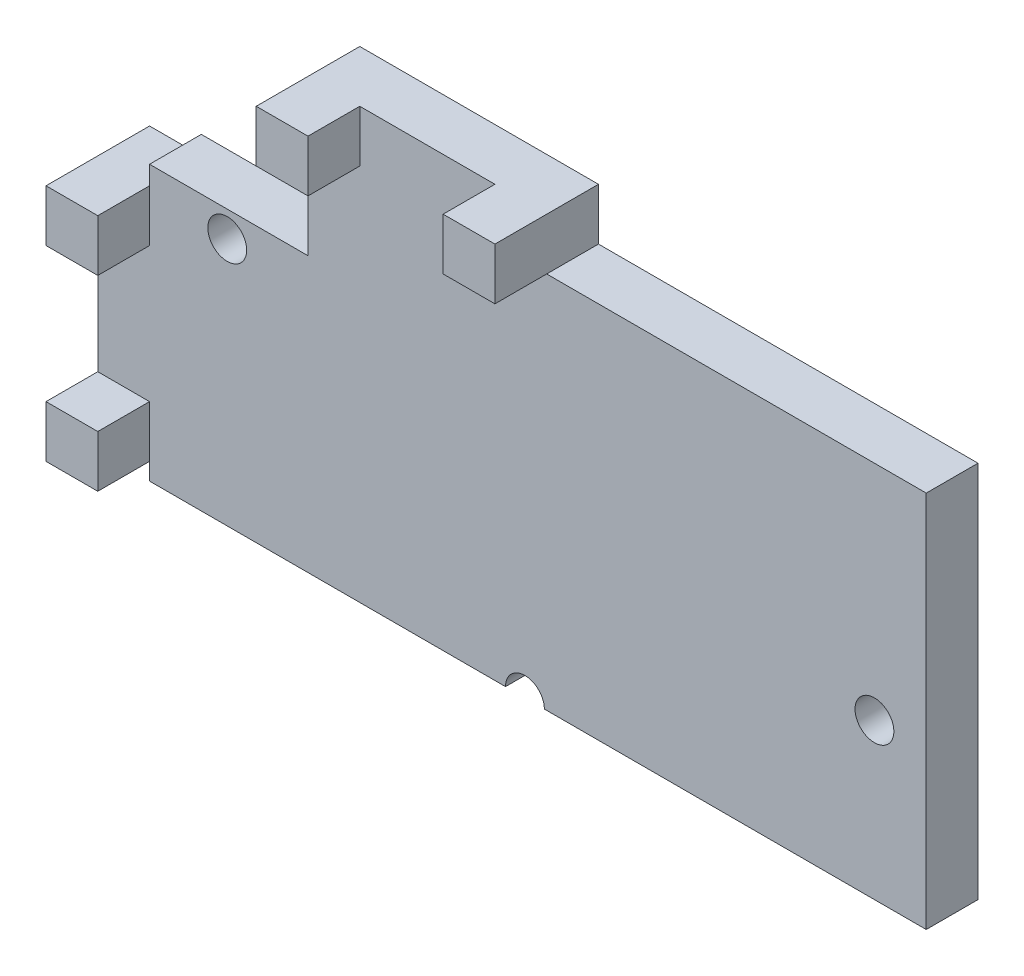
ISO-10303-21;
HEADER;
FILE_DESCRIPTION(('STEP AP214'),'2;1');
FILE_NAME('part.step','',(''),(''),'','','');
FILE_SCHEMA(('AUTOMOTIVE_DESIGN { 1 0 10303 214 1 1 1 1 }'));
ENDSEC;
DATA;
#1=APPLICATION_CONTEXT('core data for automotive mechanical design processes');
#2=APPLICATION_PROTOCOL_DEFINITION('international standard','automotive_design',2000,#1);
#3=PRODUCT_CONTEXT('',#1,'mechanical');
#4=PRODUCT('Part','Part','',(#3));
#5=PRODUCT_RELATED_PRODUCT_CATEGORY('part','',(#4));
#6=PRODUCT_DEFINITION_FORMATION('','',#4);
#7=PRODUCT_DEFINITION_CONTEXT('part definition',#1,'design');
#8=PRODUCT_DEFINITION('design','',#6,#7);
#9=PRODUCT_DEFINITION_SHAPE('','',#8);
#10=(LENGTH_UNIT() NAMED_UNIT(*) SI_UNIT(.MILLI.,.METRE.));
#11=(NAMED_UNIT(*) PLANE_ANGLE_UNIT() SI_UNIT($,.RADIAN.));
#12=(NAMED_UNIT(*) SI_UNIT($,.STERADIAN.) SOLID_ANGLE_UNIT());
#13=UNCERTAINTY_MEASURE_WITH_UNIT(LENGTH_MEASURE(1.E-05),#10,'distance_accuracy_value','');
#14=(GEOMETRIC_REPRESENTATION_CONTEXT(3) GLOBAL_UNCERTAINTY_ASSIGNED_CONTEXT((#13)) GLOBAL_UNIT_ASSIGNED_CONTEXT((#10,
#11,#12)) REPRESENTATION_CONTEXT('',''));
#15=CARTESIAN_POINT('',(0.,0.,0.));
#16=DIRECTION('',(0.,0.,1.));
#17=DIRECTION('',(1.,0.,0.));
#18=AXIS2_PLACEMENT_3D('',#15,#16,#17);
#19=CARTESIAN_POINT('',(-5.5945945945946,-3.48648648648649,1.));
#20=DIRECTION('',(0.,1.,0.));
#21=DIRECTION('',(0.,0.,1.));
#22=AXIS2_PLACEMENT_3D('',#19,#20,#21);
#23=PLANE('',#22);
#24=DIRECTION('',(1.,0.,0.));
#25=VECTOR('',#24,1.);
#26=CARTESIAN_POINT('',(-5.5945945945946,-3.48648648648649,1.));
#27=LINE('',#26,#25);
#28=CARTESIAN_POINT('',(2.0304054054054,-3.48648648648649,1.));
#29=VERTEX_POINT('',#28);
#30=CARTESIAN_POINT('',(9.4054054054054,-3.48648648648649,1.));
#31=VERTEX_POINT('',#30);
#32=EDGE_CURVE('E221',#29,#31,#27,.T.);
#33=ORIENTED_EDGE('',*,*,#32,.F.);
#34=DIRECTION('',(0.,0.,-1.));
#35=VECTOR('',#34,1.);
#36=CARTESIAN_POINT('',(2.0304054054054,-3.48648648648649,1.));
#37=LINE('',#36,#35);
#38=CARTESIAN_POINT('',(2.0304054054054,-3.48648648648649,0.));
#39=VERTEX_POINT('',#38);
#40=EDGE_CURVE('E200',#29,#39,#37,.T.);
#41=ORIENTED_EDGE('',*,*,#40,.T.);
#42=DIRECTION('',(1.,0.,0.));
#43=VECTOR('',#42,1.);
#44=CARTESIAN_POINT('',(-5.5945945945946,-3.48648648648649,0.));
#45=LINE('',#44,#43);
#46=CARTESIAN_POINT('',(9.4054054054054,-3.48648648648649,0.));
#47=VERTEX_POINT('',#46);
#48=EDGE_CURVE('E234',#39,#47,#45,.T.);
#49=ORIENTED_EDGE('',*,*,#48,.T.);
#50=DIRECTION('',(0.,0.,-1.));
#51=VECTOR('',#50,1.);
#52=CARTESIAN_POINT('',(9.4054054054054,-3.48648648648649,1.));
#53=LINE('',#52,#51);
#54=EDGE_CURVE('E41',#31,#47,#53,.T.);
#55=ORIENTED_EDGE('',*,*,#54,.F.);
#56=EDGE_LOOP('',(#33,#41,#49,#55));
#57=FACE_BOUND('',#56,.T.);
#58=ADVANCED_FACE('F33',(#57),#23,.F.);
#59=CARTESIAN_POINT('',(0.,0.,1.));
#60=DIRECTION('',(0.,0.,1.));
#61=DIRECTION('',(1.,0.,0.));
#62=AXIS2_PLACEMENT_3D('',#59,#60,#61);
#63=PLANE('',#62);
#64=CARTESIAN_POINT('',(1.6554054054054,-3.48648648648649,1.));
#65=DIRECTION('',(0.,0.,-1.));
#66=DIRECTION('',(-1.,0.,0.));
#67=AXIS2_PLACEMENT_3D('',#64,#65,#66);
#68=CIRCLE('',#67,0.375000000000001);
#69=CARTESIAN_POINT('',(1.2804054054054,-3.48648648648649,1.));
#70=VERTEX_POINT('',#69);
#71=EDGE_CURVE('E197',#70,#29,#68,.T.);
#72=ORIENTED_EDGE('',*,*,#71,.T.);
#73=ORIENTED_EDGE('',*,*,#32,.T.);
#74=DIRECTION('',(0.,1.,0.));
#75=VECTOR('',#74,1.);
#76=CARTESIAN_POINT('',(9.4054054054054,3.81351351351351,1.));
#77=LINE('',#76,#75);
#78=CARTESIAN_POINT('',(9.4054054054054,3.81351351351351,1.));
#79=VERTEX_POINT('',#78);
#80=EDGE_CURVE('E220',#31,#79,#77,.T.);
#81=ORIENTED_EDGE('',*,*,#80,.T.);
#82=DIRECTION('',(-1.,0.,0.));
#83=VECTOR('',#82,1.);
#84=CARTESIAN_POINT('',(-5.5945945945946,3.81351351351351,1.));
#85=LINE('',#84,#83);
#86=CARTESIAN_POINT('',(2.0754054054054,3.81351351351351,1.));
#87=VERTEX_POINT('',#86);
#88=EDGE_CURVE('E223',#79,#87,#85,.T.);
#89=ORIENTED_EDGE('',*,*,#88,.T.);
#90=DIRECTION('',(1.,0.,0.));
#91=VECTOR('',#90,1.);
#92=CARTESIAN_POINT('',(2.0754054054054,3.81351351351351,1.));
#93=LINE('',#92,#91);
#94=CARTESIAN_POINT('',(1.0754054054054,3.81351351351351,1.));
#95=VERTEX_POINT('',#94);
#96=EDGE_CURVE('E264',#95,#87,#93,.T.);
#97=ORIENTED_EDGE('',*,*,#96,.F.);
#98=DIRECTION('',(0.,-1.,0.));
#99=VECTOR('',#98,1.);
#100=CARTESIAN_POINT('',(1.0754054054054,3.81351351351351,1.));
#101=LINE('',#100,#99);
#102=CARTESIAN_POINT('',(1.0754054054054,4.81351351351351,1.));
#103=VERTEX_POINT('',#102);
#104=EDGE_CURVE('E277',#103,#95,#101,.T.);
#105=ORIENTED_EDGE('',*,*,#104,.F.);
#106=DIRECTION('',(-1.,0.,0.));
#107=VECTOR('',#106,1.);
#108=CARTESIAN_POINT('',(-2.5345945945946,4.81351351351351,1.));
#109=LINE('',#108,#107);
#110=CARTESIAN_POINT('',(-1.53459459459459,4.81351351351351,1.));
#111=VERTEX_POINT('',#110);
#112=EDGE_CURVE('E317',#103,#111,#109,.T.);
#113=ORIENTED_EDGE('',*,*,#112,.T.);
#114=DIRECTION('',(0.,1.,0.));
#115=VECTOR('',#114,1.);
#116=CARTESIAN_POINT('',(-1.53459459459459,4.81351351351351,1.));
#117=LINE('',#116,#115);
#118=CARTESIAN_POINT('',(-1.53459459459459,3.81351351351351,1.));
#119=VERTEX_POINT('',#118);
#120=EDGE_CURVE('E297',#119,#111,#117,.T.);
#121=ORIENTED_EDGE('',*,*,#120,.F.);
#122=DIRECTION('',(1.,0.,0.));
#123=VECTOR('',#122,1.);
#124=CARTESIAN_POINT('',(-2.53459459459459,3.81351351351351,1.));
#125=LINE('',#124,#123);
#126=CARTESIAN_POINT('',(-2.5345945945946,3.81351351351351,1.));
#127=VERTEX_POINT('',#126);
#128=EDGE_CURVE('E292',#127,#119,#125,.T.);
#129=ORIENTED_EDGE('',*,*,#128,.F.);
#130=DIRECTION('',(0.,-1.,0.));
#131=VECTOR('',#130,1.);
#132=CARTESIAN_POINT('',(-2.5345945945946,3.81351351351351,1.));
#133=LINE('',#132,#131);
#134=CARTESIAN_POINT('',(-2.5345945945946,1.81351351351351,1.));
#135=VERTEX_POINT('',#134);
#136=EDGE_CURVE('E329',#127,#135,#133,.T.);
#137=ORIENTED_EDGE('',*,*,#136,.T.);
#138=DIRECTION('',(-1.,0.,0.));
#139=VECTOR('',#138,1.);
#140=CARTESIAN_POINT('',(-5.5945945945946,1.81351351351351,1.));
#141=LINE('',#140,#139);
#142=CARTESIAN_POINT('',(-5.5945945945946,1.81351351351351,1.));
#143=VERTEX_POINT('',#142);
#144=EDGE_CURVE('E331',#135,#143,#141,.T.);
#145=ORIENTED_EDGE('',*,*,#144,.T.);
#146=DIRECTION('',(0.,-1.,0.));
#147=VECTOR('',#146,1.);
#148=CARTESIAN_POINT('',(-5.5945945945946,3.81351351351351,1.));
#149=LINE('',#148,#147);
#150=CARTESIAN_POINT('',(-5.5945945945946,1.45351351351351,1.));
#151=VERTEX_POINT('',#150);
#152=EDGE_CURVE('E225',#143,#151,#149,.T.);
#153=ORIENTED_EDGE('',*,*,#152,.T.);
#154=DIRECTION('',(0.,1.,0.));
#155=VECTOR('',#154,1.);
#156=CARTESIAN_POINT('',(-5.5945945945946,1.45351351351351,1.));
#157=LINE('',#156,#155);
#158=CARTESIAN_POINT('',(-5.5945945945946,0.453513513513511,1.));
#159=VERTEX_POINT('',#158);
#160=EDGE_CURVE('E406',#159,#151,#157,.T.);
#161=ORIENTED_EDGE('',*,*,#160,.F.);
#162=DIRECTION('',(1.,0.,0.));
#163=VECTOR('',#162,1.);
#164=CARTESIAN_POINT('',(-6.5945945945946,0.453513513513511,1.));
#165=LINE('',#164,#163);
#166=CARTESIAN_POINT('',(-6.5945945945946,0.453513513513511,1.));
#167=VERTEX_POINT('',#166);
#168=EDGE_CURVE('E408',#167,#159,#165,.T.);
#169=ORIENTED_EDGE('',*,*,#168,.F.);
#170=DIRECTION('',(0.,1.,0.));
#171=VECTOR('',#170,1.);
#172=CARTESIAN_POINT('',(-6.5945945945946,-3.15648648648649,1.));
#173=LINE('',#172,#171);
#174=CARTESIAN_POINT('',(-6.5945945945946,-2.15648648648649,1.));
#175=VERTEX_POINT('',#174);
#176=EDGE_CURVE('E445',#175,#167,#173,.T.);
#177=ORIENTED_EDGE('',*,*,#176,.F.);
#178=DIRECTION('',(-1.,0.,0.));
#179=VECTOR('',#178,1.);
#180=CARTESIAN_POINT('',(-6.5945945945946,-2.15648648648649,1.));
#181=LINE('',#180,#179);
#182=CARTESIAN_POINT('',(-5.5945945945946,-2.15648648648649,1.));
#183=VERTEX_POINT('',#182);
#184=EDGE_CURVE('E431',#183,#175,#181,.T.);
#185=ORIENTED_EDGE('',*,*,#184,.F.);
#186=DIRECTION('',(0.,1.,0.));
#187=VECTOR('',#186,1.);
#188=CARTESIAN_POINT('',(-5.5945945945946,-3.15648648648649,1.));
#189=LINE('',#188,#187);
#190=CARTESIAN_POINT('',(-5.5945945945946,-3.15648648648649,1.));
#191=VERTEX_POINT('',#190);
#192=EDGE_CURVE('E426',#191,#183,#189,.T.);
#193=ORIENTED_EDGE('',*,*,#192,.F.);
#194=CARTESIAN_POINT('',(-5.5945945945946,-3.48648648648649,1.));
#195=VERTEX_POINT('',#194);
#196=EDGE_CURVE('E219',#191,#195,#149,.T.);
#197=ORIENTED_EDGE('',*,*,#196,.T.);
#198=EDGE_CURVE('E210',#195,#70,#27,.T.);
#199=ORIENTED_EDGE('',*,*,#198,.T.);
#200=EDGE_LOOP('',(#72,#73,#81,#89,#97,#105,#113,#121,#129,#137,#145,#153,#161,#169,#177,#185,
#193,#197,#199));
#201=FACE_BOUND('',#200,.T.);
#202=CARTESIAN_POINT('',(-4.0945945945946,1.31351351351351,1.));
#203=DIRECTION('',(0.,0.,-1.));
#204=DIRECTION('',(-1.,0.,0.));
#205=AXIS2_PLACEMENT_3D('',#202,#203,#204);
#206=CIRCLE('',#205,0.375000000000001);
#207=CARTESIAN_POINT('',(-4.4695945945946,1.31351351351351,1.));
#208=VERTEX_POINT('',#207);
#209=EDGE_CURVE('E467',#208,#208,#206,.T.);
#210=ORIENTED_EDGE('',*,*,#209,.T.);
#211=EDGE_LOOP('',(#210));
#212=FACE_BOUND('',#211,.T.);
#213=CARTESIAN_POINT('',(8.4054054054054,-0.486486486486489,1.));
#214=DIRECTION('',(0.,0.,-1.));
#215=DIRECTION('',(-1.,0.,0.));
#216=AXIS2_PLACEMENT_3D('',#213,#214,#215);
#217=CIRCLE('',#216,0.375000000000001);
#218=CARTESIAN_POINT('',(8.0304054054054,-0.486486486486489,1.));
#219=VERTEX_POINT('',#218);
#220=EDGE_CURVE('E416',#219,#219,#217,.T.);
#221=ORIENTED_EDGE('',*,*,#220,.T.);
#222=EDGE_LOOP('',(#221));
#223=FACE_BOUND('',#222,.T.);
#224=ADVANCED_FACE('F215',(#201,#212,#223),#63,.T.);
#225=CARTESIAN_POINT('',(-5.5945945945946,3.81351351351351,1.));
#226=DIRECTION('',(1.,0.,0.));
#227=DIRECTION('',(0.,0.,-1.));
#228=AXIS2_PLACEMENT_3D('',#225,#226,#227);
#229=PLANE('',#228);
#230=DIRECTION('',(0.,0.,-1.));
#231=VECTOR('',#230,1.);
#232=CARTESIAN_POINT('',(-5.5945945945946,1.45351351351351,1.));
#233=LINE('',#232,#231);
#234=CARTESIAN_POINT('',(-5.5945945945946,1.45351351351351,0.));
#235=VERTEX_POINT('',#234);
#236=EDGE_CURVE('E360',#151,#235,#233,.T.);
#237=ORIENTED_EDGE('',*,*,#236,.F.);
#238=ORIENTED_EDGE('',*,*,#152,.F.);
#239=DIRECTION('',(0.,0.,-1.));
#240=VECTOR('',#239,1.);
#241=CARTESIAN_POINT('',(-5.5945945945946,1.81351351351351,1.));
#242=LINE('',#241,#240);
#243=CARTESIAN_POINT('',(-5.5945945945946,1.81351351351351,0.));
#244=VERTEX_POINT('',#243);
#245=EDGE_CURVE('E339',#143,#244,#242,.T.);
#246=ORIENTED_EDGE('',*,*,#245,.T.);
#247=DIRECTION('',(0.,-1.,0.));
#248=VECTOR('',#247,1.);
#249=CARTESIAN_POINT('',(-5.5945945945946,3.81351351351351,0.));
#250=LINE('',#249,#248);
#251=EDGE_CURVE('E232',#244,#235,#250,.T.);
#252=ORIENTED_EDGE('',*,*,#251,.T.);
#253=EDGE_LOOP('',(#237,#238,#246,#252));
#254=FACE_BOUND('',#253,.T.);
#255=ADVANCED_FACE('F35',(#254),#229,.F.);
#256=DIRECTION('',(0.,0.,1.));
#257=VECTOR('',#256,1.);
#258=CARTESIAN_POINT('',(-5.5945945945946,-3.15648648648649,0.));
#259=LINE('',#258,#257);
#260=CARTESIAN_POINT('',(-5.5945945945946,-3.15648648648649,0.));
#261=VERTEX_POINT('',#260);
#262=EDGE_CURVE('E369',#261,#191,#259,.T.);
#263=ORIENTED_EDGE('',*,*,#262,.F.);
#264=CARTESIAN_POINT('',(-5.5945945945946,-3.48648648648649,0.));
#265=VERTEX_POINT('',#264);
#266=EDGE_CURVE('E235',#261,#265,#250,.T.);
#267=ORIENTED_EDGE('',*,*,#266,.T.);
#268=DIRECTION('',(0.,0.,-1.));
#269=VECTOR('',#268,1.);
#270=CARTESIAN_POINT('',(-5.5945945945946,-3.48648648648649,1.));
#271=LINE('',#270,#269);
#272=EDGE_CURVE('E11',#195,#265,#271,.T.);
#273=ORIENTED_EDGE('',*,*,#272,.F.);
#274=ORIENTED_EDGE('',*,*,#196,.F.);
#275=EDGE_LOOP('',(#263,#267,#273,#274));
#276=FACE_BOUND('',#275,.T.);
#277=ADVANCED_FACE('F477',(#276),#229,.F.);
#278=CARTESIAN_POINT('',(1.2804054054054,-3.48648648648649,0.));
#279=VERTEX_POINT('',#278);
#280=EDGE_CURVE('E213',#265,#279,#45,.T.);
#281=ORIENTED_EDGE('',*,*,#280,.T.);
#282=DIRECTION('',(0.,0.,-1.));
#283=VECTOR('',#282,1.);
#284=CARTESIAN_POINT('',(1.2804054054054,-3.48648648648649,1.));
#285=LINE('',#284,#283);
#286=EDGE_CURVE('E48',#279,#70,#285,.F.);
#287=ORIENTED_EDGE('',*,*,#286,.T.);
#288=ORIENTED_EDGE('',*,*,#198,.F.);
#289=ORIENTED_EDGE('',*,*,#272,.T.);
#290=EDGE_LOOP('',(#281,#287,#288,#289));
#291=FACE_BOUND('',#290,.T.);
#292=ADVANCED_FACE('F209',(#291),#23,.F.);
#293=CARTESIAN_POINT('',(9.4054054054054,3.81351351351351,1.));
#294=DIRECTION('',(-1.,0.,0.));
#295=DIRECTION('',(0.,0.,1.));
#296=AXIS2_PLACEMENT_3D('',#293,#294,#295);
#297=PLANE('',#296);
#298=DIRECTION('',(0.,1.,0.));
#299=VECTOR('',#298,1.);
#300=CARTESIAN_POINT('',(9.4054054054054,3.81351351351351,0.));
#301=LINE('',#300,#299);
#302=CARTESIAN_POINT('',(9.4054054054054,3.81351351351351,0.));
#303=VERTEX_POINT('',#302);
#304=EDGE_CURVE('E237',#47,#303,#301,.T.);
#305=ORIENTED_EDGE('',*,*,#304,.T.);
#306=DIRECTION('',(0.,0.,-1.));
#307=VECTOR('',#306,1.);
#308=CARTESIAN_POINT('',(9.4054054054054,3.81351351351351,1.));
#309=LINE('',#308,#307);
#310=EDGE_CURVE('E231',#79,#303,#309,.T.);
#311=ORIENTED_EDGE('',*,*,#310,.F.);
#312=ORIENTED_EDGE('',*,*,#80,.F.);
#313=ORIENTED_EDGE('',*,*,#54,.T.);
#314=EDGE_LOOP('',(#305,#311,#312,#313));
#315=FACE_BOUND('',#314,.T.);
#316=ADVANCED_FACE('F248',(#315),#297,.F.);
#317=CARTESIAN_POINT('',(-5.5945945945946,3.81351351351351,1.));
#318=DIRECTION('',(0.,-1.,0.));
#319=DIRECTION('',(0.,0.,-1.));
#320=AXIS2_PLACEMENT_3D('',#317,#318,#319);
#321=PLANE('',#320);
#322=DIRECTION('',(-1.,0.,0.));
#323=VECTOR('',#322,1.);
#324=CARTESIAN_POINT('',(-5.5945945945946,3.81351351351351,0.));
#325=LINE('',#324,#323);
#326=CARTESIAN_POINT('',(2.07540540540541,3.81351351351351,0.));
#327=VERTEX_POINT('',#326);
#328=EDGE_CURVE('E239',#303,#327,#325,.T.);
#329=ORIENTED_EDGE('',*,*,#328,.T.);
#330=DIRECTION('',(0.,0.,1.));
#331=VECTOR('',#330,1.);
#332=CARTESIAN_POINT('',(2.07540540540541,3.81351351351351,0.));
#333=LINE('',#332,#331);
#334=EDGE_CURVE('E262',#327,#87,#333,.T.);
#335=ORIENTED_EDGE('',*,*,#334,.T.);
#336=ORIENTED_EDGE('',*,*,#88,.F.);
#337=ORIENTED_EDGE('',*,*,#310,.T.);
#338=EDGE_LOOP('',(#329,#335,#336,#337));
#339=FACE_BOUND('',#338,.T.);
#340=ADVANCED_FACE('F260',(#339),#321,.F.);
#341=CARTESIAN_POINT('',(0.,0.,0.));
#342=DIRECTION('',(0.,0.,1.));
#343=DIRECTION('',(1.,0.,0.));
#344=AXIS2_PLACEMENT_3D('',#341,#342,#343);
#345=PLANE('',#344);
#346=CARTESIAN_POINT('',(-4.0945945945946,1.31351351351351,0.));
#347=DIRECTION('',(0.,0.,-1.));
#348=DIRECTION('',(-1.,0.,0.));
#349=AXIS2_PLACEMENT_3D('',#346,#347,#348);
#350=CIRCLE('',#349,0.375000000000001);
#351=CARTESIAN_POINT('',(-4.4695945945946,1.31351351351351,0.));
#352=VERTEX_POINT('',#351);
#353=EDGE_CURVE('E464',#352,#352,#350,.T.);
#354=ORIENTED_EDGE('',*,*,#353,.F.);
#355=EDGE_LOOP('',(#354));
#356=FACE_BOUND('',#355,.T.);
#357=CARTESIAN_POINT('',(8.4054054054054,-0.486486486486489,0.));
#358=DIRECTION('',(0.,0.,-1.));
#359=DIRECTION('',(-1.,0.,0.));
#360=AXIS2_PLACEMENT_3D('',#357,#358,#359);
#361=CIRCLE('',#360,0.375000000000001);
#362=CARTESIAN_POINT('',(8.0304054054054,-0.486486486486489,0.));
#363=VERTEX_POINT('',#362);
#364=EDGE_CURVE('E458',#363,#363,#361,.T.);
#365=ORIENTED_EDGE('',*,*,#364,.F.);
#366=EDGE_LOOP('',(#365));
#367=FACE_BOUND('',#366,.T.);
#368=ORIENTED_EDGE('',*,*,#48,.F.);
#369=CARTESIAN_POINT('',(1.6554054054054,-3.48648648648649,0.));
#370=DIRECTION('',(0.,0.,-1.));
#371=DIRECTION('',(-1.,0.,0.));
#372=AXIS2_PLACEMENT_3D('',#369,#370,#371);
#373=CIRCLE('',#372,0.375000000000001);
#374=EDGE_CURVE('E204',#279,#39,#373,.T.);
#375=ORIENTED_EDGE('',*,*,#374,.F.);
#376=ORIENTED_EDGE('',*,*,#280,.F.);
#377=ORIENTED_EDGE('',*,*,#266,.F.);
#378=DIRECTION('',(1.,0.,0.));
#379=VECTOR('',#378,1.);
#380=CARTESIAN_POINT('',(-6.5945945945946,-3.15648648648649,0.));
#381=LINE('',#380,#379);
#382=CARTESIAN_POINT('',(-6.5945945945946,-3.15648648648649,0.));
#383=VERTEX_POINT('',#382);
#384=EDGE_CURVE('E380',#383,#261,#381,.T.);
#385=ORIENTED_EDGE('',*,*,#384,.F.);
#386=DIRECTION('',(0.,-1.,0.));
#387=VECTOR('',#386,1.);
#388=CARTESIAN_POINT('',(-6.5945945945946,1.45351351351351,0.));
#389=LINE('',#388,#387);
#390=CARTESIAN_POINT('',(-6.5945945945946,1.45351351351351,0.));
#391=VERTEX_POINT('',#390);
#392=EDGE_CURVE('E368',#391,#383,#389,.T.);
#393=ORIENTED_EDGE('',*,*,#392,.F.);
#394=DIRECTION('',(1.,0.,0.));
#395=VECTOR('',#394,1.);
#396=CARTESIAN_POINT('',(-6.5945945945946,1.45351351351351,0.));
#397=LINE('',#396,#395);
#398=EDGE_CURVE('E355',#391,#235,#397,.T.);
#399=ORIENTED_EDGE('',*,*,#398,.T.);
#400=ORIENTED_EDGE('',*,*,#251,.F.);
#401=DIRECTION('',(-1.,0.,0.));
#402=VECTOR('',#401,1.);
#403=CARTESIAN_POINT('',(-5.5945945945946,1.81351351351351,0.));
#404=LINE('',#403,#402);
#405=CARTESIAN_POINT('',(-2.5345945945946,1.81351351351351,0.));
#406=VERTEX_POINT('',#405);
#407=EDGE_CURVE('E332',#406,#244,#404,.T.);
#408=ORIENTED_EDGE('',*,*,#407,.F.);
#409=DIRECTION('',(0.,-1.,0.));
#410=VECTOR('',#409,1.);
#411=CARTESIAN_POINT('',(-2.5345945945946,3.81351351351351,0.));
#412=LINE('',#411,#410);
#413=CARTESIAN_POINT('',(-2.5345945945946,4.81351351351351,0.));
#414=VERTEX_POINT('',#413);
#415=EDGE_CURVE('E325',#414,#406,#412,.T.);
#416=ORIENTED_EDGE('',*,*,#415,.F.);
#417=DIRECTION('',(-1.,0.,0.));
#418=VECTOR('',#417,1.);
#419=CARTESIAN_POINT('',(-2.5345945945946,4.81351351351351,0.));
#420=LINE('',#419,#418);
#421=CARTESIAN_POINT('',(2.07540540540541,4.81351351351351,0.));
#422=VERTEX_POINT('',#421);
#423=EDGE_CURVE('E319',#422,#414,#420,.T.);
#424=ORIENTED_EDGE('',*,*,#423,.F.);
#425=DIRECTION('',(0.,1.,0.));
#426=VECTOR('',#425,1.);
#427=CARTESIAN_POINT('',(2.07540540540541,3.81351351351351,0.));
#428=LINE('',#427,#426);
#429=EDGE_CURVE('E258',#327,#422,#428,.T.);
#430=ORIENTED_EDGE('',*,*,#429,.F.);
#431=ORIENTED_EDGE('',*,*,#328,.F.);
#432=ORIENTED_EDGE('',*,*,#304,.F.);
#433=EDGE_LOOP('',(#368,#375,#376,#377,#385,#393,#399,#400,#408,#416,#424,#430,#431,#432));
#434=FACE_BOUND('',#433,.T.);
#435=ADVANCED_FACE('F254',(#356,#367,#434),#345,.F.);
#436=CARTESIAN_POINT('',(-5.5945945945946,1.81351351351351,1.));
#437=DIRECTION('',(0.,-1.,0.));
#438=DIRECTION('',(1.,0.,0.));
#439=AXIS2_PLACEMENT_3D('',#436,#437,#438);
#440=PLANE('',#439);
#441=ORIENTED_EDGE('',*,*,#407,.T.);
#442=ORIENTED_EDGE('',*,*,#245,.F.);
#443=ORIENTED_EDGE('',*,*,#144,.F.);
#444=DIRECTION('',(0.,0.,-1.));
#445=VECTOR('',#444,1.);
#446=CARTESIAN_POINT('',(-2.5345945945946,1.81351351351351,1.));
#447=LINE('',#446,#445);
#448=EDGE_CURVE('E335',#135,#406,#447,.T.);
#449=ORIENTED_EDGE('',*,*,#448,.T.);
#450=EDGE_LOOP('',(#441,#442,#443,#449));
#451=FACE_BOUND('',#450,.T.);
#452=ADVANCED_FACE('F344',(#451),#440,.F.);
#453=CARTESIAN_POINT('',(-2.5345945945946,3.81351351351351,1.));
#454=DIRECTION('',(1.,0.,0.));
#455=DIRECTION('',(0.,0.,-1.));
#456=AXIS2_PLACEMENT_3D('',#453,#454,#455);
#457=PLANE('',#456);
#458=ORIENTED_EDGE('',*,*,#415,.T.);
#459=ORIENTED_EDGE('',*,*,#448,.F.);
#460=ORIENTED_EDGE('',*,*,#136,.F.);
#461=DIRECTION('',(0.,0.,-1.));
#462=VECTOR('',#461,1.);
#463=CARTESIAN_POINT('',(-2.53459459459459,3.81351351351351,2.));
#464=LINE('',#463,#462);
#465=CARTESIAN_POINT('',(-2.53459459459459,3.81351351351351,2.));
#466=VERTEX_POINT('',#465);
#467=EDGE_CURVE('E314',#466,#127,#464,.T.);
#468=ORIENTED_EDGE('',*,*,#467,.F.);
#469=DIRECTION('',(0.,-1.,0.));
#470=VECTOR('',#469,1.);
#471=CARTESIAN_POINT('',(-2.5345945945946,4.81351351351351,2.));
#472=LINE('',#471,#470);
#473=CARTESIAN_POINT('',(-2.5345945945946,4.81351351351351,2.));
#474=VERTEX_POINT('',#473);
#475=EDGE_CURVE('E293',#474,#466,#472,.T.);
#476=ORIENTED_EDGE('',*,*,#475,.F.);
#477=DIRECTION('',(0.,0.,1.));
#478=VECTOR('',#477,1.);
#479=CARTESIAN_POINT('',(-2.5345945945946,4.81351351351351,0.));
#480=LINE('',#479,#478);
#481=EDGE_CURVE('E323',#414,#474,#480,.T.);
#482=ORIENTED_EDGE('',*,*,#481,.F.);
#483=EDGE_LOOP('',(#458,#459,#460,#468,#476,#482));
#484=FACE_BOUND('',#483,.T.);
#485=ADVANCED_FACE('F349',(#484),#457,.F.);
#486=CARTESIAN_POINT('',(-2.5345945945946,4.81351351351351,0.));
#487=DIRECTION('',(0.,1.,0.));
#488=DIRECTION('',(0.,0.,1.));
#489=AXIS2_PLACEMENT_3D('',#486,#487,#488);
#490=PLANE('',#489);
#491=ORIENTED_EDGE('',*,*,#112,.F.);
#492=DIRECTION('',(0.,0.,-1.));
#493=VECTOR('',#492,1.);
#494=CARTESIAN_POINT('',(1.0754054054054,4.81351351351351,2.));
#495=LINE('',#494,#493);
#496=CARTESIAN_POINT('',(1.0754054054054,4.81351351351351,2.));
#497=VERTEX_POINT('',#496);
#498=EDGE_CURVE('E284',#497,#103,#495,.T.);
#499=ORIENTED_EDGE('',*,*,#498,.F.);
#500=DIRECTION('',(-1.,0.,0.));
#501=VECTOR('',#500,1.);
#502=CARTESIAN_POINT('',(1.0754054054054,4.81351351351351,2.));
#503=LINE('',#502,#501);
#504=CARTESIAN_POINT('',(2.07540540540541,4.81351351351351,2.));
#505=VERTEX_POINT('',#504);
#506=EDGE_CURVE('E276',#505,#497,#503,.T.);
#507=ORIENTED_EDGE('',*,*,#506,.F.);
#508=DIRECTION('',(0.,0.,1.));
#509=VECTOR('',#508,1.);
#510=CARTESIAN_POINT('',(2.07540540540541,4.81351351351351,0.));
#511=LINE('',#510,#509);
#512=EDGE_CURVE('E326',#422,#505,#511,.T.);
#513=ORIENTED_EDGE('',*,*,#512,.F.);
#514=ORIENTED_EDGE('',*,*,#423,.T.);
#515=ORIENTED_EDGE('',*,*,#481,.T.);
#516=DIRECTION('',(-1.,0.,0.));
#517=VECTOR('',#516,1.);
#518=CARTESIAN_POINT('',(-2.5345945945946,4.81351351351351,2.));
#519=LINE('',#518,#517);
#520=CARTESIAN_POINT('',(-1.53459459459459,4.81351351351351,2.));
#521=VERTEX_POINT('',#520);
#522=EDGE_CURVE('E301',#521,#474,#519,.T.);
#523=ORIENTED_EDGE('',*,*,#522,.F.);
#524=DIRECTION('',(0.,0.,-1.));
#525=VECTOR('',#524,1.);
#526=CARTESIAN_POINT('',(-1.53459459459459,4.81351351351351,2.));
#527=LINE('',#526,#525);
#528=EDGE_CURVE('E304',#521,#111,#527,.T.);
#529=ORIENTED_EDGE('',*,*,#528,.T.);
#530=EDGE_LOOP('',(#491,#499,#507,#513,#514,#515,#523,#529));
#531=FACE_BOUND('',#530,.T.);
#532=ADVANCED_FACE('F393',(#531),#490,.T.);
#533=CARTESIAN_POINT('',(2.07540540540541,3.81351351351351,0.));
#534=DIRECTION('',(1.,0.,0.));
#535=DIRECTION('',(0.,0.,-1.));
#536=AXIS2_PLACEMENT_3D('',#533,#534,#535);
#537=PLANE('',#536);
#538=ORIENTED_EDGE('',*,*,#512,.T.);
#539=DIRECTION('',(0.,1.,0.));
#540=VECTOR('',#539,1.);
#541=CARTESIAN_POINT('',(2.07540540540541,4.81351351351351,2.));
#542=LINE('',#541,#540);
#543=CARTESIAN_POINT('',(2.0754054054054,3.81351351351351,2.));
#544=VERTEX_POINT('',#543);
#545=EDGE_CURVE('E282',#544,#505,#542,.T.);
#546=ORIENTED_EDGE('',*,*,#545,.F.);
#547=DIRECTION('',(0.,0.,-1.));
#548=VECTOR('',#547,1.);
#549=CARTESIAN_POINT('',(2.0754054054054,3.81351351351351,2.));
#550=LINE('',#549,#548);
#551=EDGE_CURVE('E272',#544,#87,#550,.T.);
#552=ORIENTED_EDGE('',*,*,#551,.T.);
#553=ORIENTED_EDGE('',*,*,#334,.F.);
#554=ORIENTED_EDGE('',*,*,#429,.T.);
#555=EDGE_LOOP('',(#538,#546,#552,#553,#554));
#556=FACE_BOUND('',#555,.T.);
#557=ADVANCED_FACE('F280',(#556),#537,.T.);
#558=CARTESIAN_POINT('',(-2.53459459459459,3.81351351351351,2.));
#559=DIRECTION('',(0.,1.,0.));
#560=DIRECTION('',(0.,0.,1.));
#561=AXIS2_PLACEMENT_3D('',#558,#559,#560);
#562=PLANE('',#561);
#563=ORIENTED_EDGE('',*,*,#128,.T.);
#564=DIRECTION('',(0.,0.,-1.));
#565=VECTOR('',#564,1.);
#566=CARTESIAN_POINT('',(-1.53459459459459,3.81351351351351,2.));
#567=LINE('',#566,#565);
#568=CARTESIAN_POINT('',(-1.53459459459459,3.81351351351351,2.));
#569=VERTEX_POINT('',#568);
#570=EDGE_CURVE('E311',#569,#119,#567,.T.);
#571=ORIENTED_EDGE('',*,*,#570,.F.);
#572=DIRECTION('',(1.,0.,0.));
#573=VECTOR('',#572,1.);
#574=CARTESIAN_POINT('',(-2.53459459459459,3.81351351351351,2.));
#575=LINE('',#574,#573);
#576=EDGE_CURVE('E296',#466,#569,#575,.T.);
#577=ORIENTED_EDGE('',*,*,#576,.F.);
#578=ORIENTED_EDGE('',*,*,#467,.T.);
#579=EDGE_LOOP('',(#563,#571,#577,#578));
#580=FACE_BOUND('',#579,.T.);
#581=ADVANCED_FACE('F402',(#580),#562,.F.);
#582=CARTESIAN_POINT('',(-1.53459459459459,4.81351351351351,2.));
#583=DIRECTION('',(-1.,0.,0.));
#584=DIRECTION('',(0.,-1.,0.));
#585=AXIS2_PLACEMENT_3D('',#582,#583,#584);
#586=PLANE('',#585);
#587=ORIENTED_EDGE('',*,*,#120,.T.);
#588=ORIENTED_EDGE('',*,*,#528,.F.);
#589=DIRECTION('',(0.,1.,0.));
#590=VECTOR('',#589,1.);
#591=CARTESIAN_POINT('',(-1.53459459459459,4.81351351351351,2.));
#592=LINE('',#591,#590);
#593=EDGE_CURVE('E299',#569,#521,#592,.T.);
#594=ORIENTED_EDGE('',*,*,#593,.F.);
#595=ORIENTED_EDGE('',*,*,#570,.T.);
#596=EDGE_LOOP('',(#587,#588,#594,#595));
#597=FACE_BOUND('',#596,.T.);
#598=ADVANCED_FACE('F399',(#597),#586,.F.);
#599=CARTESIAN_POINT('',(0.,0.,2.));
#600=DIRECTION('',(0.,0.,1.));
#601=DIRECTION('',(1.,0.,0.));
#602=AXIS2_PLACEMENT_3D('',#599,#600,#601);
#603=PLANE('',#602);
#604=ORIENTED_EDGE('',*,*,#475,.T.);
#605=ORIENTED_EDGE('',*,*,#576,.T.);
#606=ORIENTED_EDGE('',*,*,#593,.T.);
#607=ORIENTED_EDGE('',*,*,#522,.T.);
#608=EDGE_LOOP('',(#604,#605,#606,#607));
#609=FACE_BOUND('',#608,.T.);
#610=ADVANCED_FACE('F536',(#609),#603,.T.);
#611=CARTESIAN_POINT('',(1.0754054054054,3.81351351351351,2.));
#612=DIRECTION('',(1.,0.,0.));
#613=DIRECTION('',(0.,0.,-1.));
#614=AXIS2_PLACEMENT_3D('',#611,#612,#613);
#615=PLANE('',#614);
#616=ORIENTED_EDGE('',*,*,#104,.T.);
#617=DIRECTION('',(0.,0.,-1.));
#618=VECTOR('',#617,1.);
#619=CARTESIAN_POINT('',(1.0754054054054,3.81351351351351,2.));
#620=LINE('',#619,#618);
#621=CARTESIAN_POINT('',(1.0754054054054,3.81351351351351,2.));
#622=VERTEX_POINT('',#621);
#623=EDGE_CURVE('E275',#622,#95,#620,.T.);
#624=ORIENTED_EDGE('',*,*,#623,.F.);
#625=DIRECTION('',(0.,-1.,0.));
#626=VECTOR('',#625,1.);
#627=CARTESIAN_POINT('',(1.0754054054054,3.81351351351351,2.));
#628=LINE('',#627,#626);
#629=EDGE_CURVE('E386',#497,#622,#628,.T.);
#630=ORIENTED_EDGE('',*,*,#629,.F.);
#631=ORIENTED_EDGE('',*,*,#498,.T.);
#632=EDGE_LOOP('',(#616,#624,#630,#631));
#633=FACE_BOUND('',#632,.T.);
#634=ADVANCED_FACE('F389',(#633),#615,.F.);
#635=CARTESIAN_POINT('',(2.0754054054054,3.81351351351351,2.));
#636=DIRECTION('',(0.,1.,0.));
#637=DIRECTION('',(0.,0.,1.));
#638=AXIS2_PLACEMENT_3D('',#635,#636,#637);
#639=PLANE('',#638);
#640=ORIENTED_EDGE('',*,*,#96,.T.);
#641=ORIENTED_EDGE('',*,*,#551,.F.);
#642=DIRECTION('',(1.,0.,0.));
#643=VECTOR('',#642,1.);
#644=CARTESIAN_POINT('',(2.0754054054054,3.81351351351351,2.));
#645=LINE('',#644,#643);
#646=EDGE_CURVE('E286',#622,#544,#645,.T.);
#647=ORIENTED_EDGE('',*,*,#646,.F.);
#648=ORIENTED_EDGE('',*,*,#623,.T.);
#649=EDGE_LOOP('',(#640,#641,#647,#648));
#650=FACE_BOUND('',#649,.T.);
#651=ADVANCED_FACE('F270',(#650),#639,.F.);
#652=CARTESIAN_POINT('',(0.,0.,2.));
#653=DIRECTION('',(0.,0.,-1.));
#654=DIRECTION('',(-1.,0.,0.));
#655=AXIS2_PLACEMENT_3D('',#652,#653,#654);
#656=PLANE('',#655);
#657=ORIENTED_EDGE('',*,*,#506,.T.);
#658=ORIENTED_EDGE('',*,*,#629,.T.);
#659=ORIENTED_EDGE('',*,*,#646,.T.);
#660=ORIENTED_EDGE('',*,*,#545,.T.);
#661=EDGE_LOOP('',(#657,#658,#659,#660));
#662=FACE_BOUND('',#661,.T.);
#663=ADVANCED_FACE('F528',(#662),#656,.F.);
#664=CARTESIAN_POINT('',(-6.5945945945946,-3.15648648648649,0.));
#665=DIRECTION('',(0.,1.,0.));
#666=DIRECTION('',(0.,0.,1.));
#667=AXIS2_PLACEMENT_3D('',#664,#665,#666);
#668=PLANE('',#667);
#669=ORIENTED_EDGE('',*,*,#262,.T.);
#670=DIRECTION('',(0.,0.,-1.));
#671=VECTOR('',#670,1.);
#672=CARTESIAN_POINT('',(-5.5945945945946,-3.15648648648649,2.));
#673=LINE('',#672,#671);
#674=CARTESIAN_POINT('',(-5.5945945945946,-3.15648648648649,2.));
#675=VERTEX_POINT('',#674);
#676=EDGE_CURVE('E375',#675,#191,#673,.T.);
#677=ORIENTED_EDGE('',*,*,#676,.F.);
#678=DIRECTION('',(1.,0.,0.));
#679=VECTOR('',#678,1.);
#680=CARTESIAN_POINT('',(-6.5945945945946,-3.15648648648649,2.));
#681=LINE('',#680,#679);
#682=CARTESIAN_POINT('',(-6.5945945945946,-3.15648648648649,2.));
#683=VERTEX_POINT('',#682);
#684=EDGE_CURVE('E430',#683,#675,#681,.T.);
#685=ORIENTED_EDGE('',*,*,#684,.F.);
#686=DIRECTION('',(0.,0.,1.));
#687=VECTOR('',#686,1.);
#688=CARTESIAN_POINT('',(-6.5945945945946,-3.15648648648649,0.));
#689=LINE('',#688,#687);
#690=EDGE_CURVE('E372',#383,#683,#689,.T.);
#691=ORIENTED_EDGE('',*,*,#690,.F.);
#692=ORIENTED_EDGE('',*,*,#384,.T.);
#693=EDGE_LOOP('',(#669,#677,#685,#691,#692));
#694=FACE_BOUND('',#693,.T.);
#695=ADVANCED_FACE('F489',(#694),#668,.F.);
#696=CARTESIAN_POINT('',(-6.5945945945946,1.45351351351351,1.));
#697=DIRECTION('',(0.,-1.,0.));
#698=DIRECTION('',(0.,0.,-1.));
#699=AXIS2_PLACEMENT_3D('',#696,#697,#698);
#700=PLANE('',#699);
#701=ORIENTED_EDGE('',*,*,#236,.T.);
#702=ORIENTED_EDGE('',*,*,#398,.F.);
#703=DIRECTION('',(0.,0.,-1.));
#704=VECTOR('',#703,1.);
#705=CARTESIAN_POINT('',(-6.5945945945946,1.45351351351351,1.));
#706=LINE('',#705,#704);
#707=CARTESIAN_POINT('',(-6.5945945945946,1.45351351351351,2.));
#708=VERTEX_POINT('',#707);
#709=EDGE_CURVE('E381',#708,#391,#706,.T.);
#710=ORIENTED_EDGE('',*,*,#709,.F.);
#711=DIRECTION('',(-1.,0.,0.));
#712=VECTOR('',#711,1.);
#713=CARTESIAN_POINT('',(-6.5945945945946,1.45351351351351,2.));
#714=LINE('',#713,#712);
#715=CARTESIAN_POINT('',(-5.5945945945946,1.45351351351351,2.));
#716=VERTEX_POINT('',#715);
#717=EDGE_CURVE('E422',#716,#708,#714,.T.);
#718=ORIENTED_EDGE('',*,*,#717,.F.);
#719=DIRECTION('',(0.,0.,-1.));
#720=VECTOR('',#719,1.);
#721=CARTESIAN_POINT('',(-5.5945945945946,1.45351351351351,2.));
#722=LINE('',#721,#720);
#723=EDGE_CURVE('E367',#716,#151,#722,.T.);
#724=ORIENTED_EDGE('',*,*,#723,.T.);
#725=EDGE_LOOP('',(#701,#702,#710,#718,#724));
#726=FACE_BOUND('',#725,.T.);
#727=ADVANCED_FACE('F364',(#726),#700,.F.);
#728=CARTESIAN_POINT('',(-6.5945945945946,0.,0.));
#729=DIRECTION('',(-1.,0.,0.));
#730=DIRECTION('',(0.,0.,1.));
#731=AXIS2_PLACEMENT_3D('',#728,#729,#730);
#732=PLANE('',#731);
#733=ORIENTED_EDGE('',*,*,#392,.T.);
#734=ORIENTED_EDGE('',*,*,#690,.T.);
#735=DIRECTION('',(0.,-1.,0.));
#736=VECTOR('',#735,1.);
#737=CARTESIAN_POINT('',(-6.5945945945946,-3.15648648648649,2.));
#738=LINE('',#737,#736);
#739=CARTESIAN_POINT('',(-6.5945945945946,-2.15648648648649,2.));
#740=VERTEX_POINT('',#739);
#741=EDGE_CURVE('E427',#740,#683,#738,.T.);
#742=ORIENTED_EDGE('',*,*,#741,.F.);
#743=DIRECTION('',(0.,0.,-1.));
#744=VECTOR('',#743,1.);
#745=CARTESIAN_POINT('',(-6.5945945945946,-2.15648648648649,2.));
#746=LINE('',#745,#744);
#747=EDGE_CURVE('E56',#740,#175,#746,.T.);
#748=ORIENTED_EDGE('',*,*,#747,.T.);
#749=ORIENTED_EDGE('',*,*,#176,.T.);
#750=DIRECTION('',(0.,0.,-1.));
#751=VECTOR('',#750,1.);
#752=CARTESIAN_POINT('',(-6.5945945945946,0.453513513513511,2.));
#753=LINE('',#752,#751);
#754=CARTESIAN_POINT('',(-6.5945945945946,0.453513513513511,2.));
#755=VERTEX_POINT('',#754);
#756=EDGE_CURVE('E424',#755,#167,#753,.T.);
#757=ORIENTED_EDGE('',*,*,#756,.F.);
#758=DIRECTION('',(0.,-1.,0.));
#759=VECTOR('',#758,1.);
#760=CARTESIAN_POINT('',(-6.5945945945946,1.45351351351351,2.));
#761=LINE('',#760,#759);
#762=EDGE_CURVE('E411',#708,#755,#761,.T.);
#763=ORIENTED_EDGE('',*,*,#762,.F.);
#764=ORIENTED_EDGE('',*,*,#709,.T.);
#765=EDGE_LOOP('',(#733,#734,#742,#748,#749,#757,#763,#764));
#766=FACE_BOUND('',#765,.T.);
#767=ADVANCED_FACE('F447',(#766),#732,.T.);
#768=CARTESIAN_POINT('',(-5.5945945945946,-3.15648648648649,2.));
#769=DIRECTION('',(-1.,0.,0.));
#770=DIRECTION('',(0.,0.,1.));
#771=AXIS2_PLACEMENT_3D('',#768,#769,#770);
#772=PLANE('',#771);
#773=ORIENTED_EDGE('',*,*,#192,.T.);
#774=DIRECTION('',(0.,0.,-1.));
#775=VECTOR('',#774,1.);
#776=CARTESIAN_POINT('',(-5.5945945945946,-2.15648648648649,2.));
#777=LINE('',#776,#775);
#778=CARTESIAN_POINT('',(-5.5945945945946,-2.15648648648649,2.));
#779=VERTEX_POINT('',#778);
#780=EDGE_CURVE('E440',#779,#183,#777,.T.);
#781=ORIENTED_EDGE('',*,*,#780,.F.);
#782=DIRECTION('',(0.,1.,0.));
#783=VECTOR('',#782,1.);
#784=CARTESIAN_POINT('',(-5.5945945945946,-3.15648648648649,2.));
#785=LINE('',#784,#783);
#786=EDGE_CURVE('E433',#675,#779,#785,.T.);
#787=ORIENTED_EDGE('',*,*,#786,.F.);
#788=ORIENTED_EDGE('',*,*,#676,.T.);
#789=EDGE_LOOP('',(#773,#781,#787,#788));
#790=FACE_BOUND('',#789,.T.);
#791=ADVANCED_FACE('F518',(#790),#772,.F.);
#792=CARTESIAN_POINT('',(-6.5945945945946,-2.15648648648649,2.));
#793=DIRECTION('',(0.,-1.,0.));
#794=DIRECTION('',(0.,0.,-1.));
#795=AXIS2_PLACEMENT_3D('',#792,#793,#794);
#796=PLANE('',#795);
#797=ORIENTED_EDGE('',*,*,#184,.T.);
#798=ORIENTED_EDGE('',*,*,#747,.F.);
#799=DIRECTION('',(-1.,0.,0.));
#800=VECTOR('',#799,1.);
#801=CARTESIAN_POINT('',(-6.5945945945946,-2.15648648648649,2.));
#802=LINE('',#801,#800);
#803=EDGE_CURVE('E435',#779,#740,#802,.T.);
#804=ORIENTED_EDGE('',*,*,#803,.F.);
#805=ORIENTED_EDGE('',*,*,#780,.T.);
#806=EDGE_LOOP('',(#797,#798,#804,#805));
#807=FACE_BOUND('',#806,.T.);
#808=ADVANCED_FACE('F497',(#807),#796,.F.);
#809=CARTESIAN_POINT('',(0.,0.,2.));
#810=DIRECTION('',(0.,0.,-1.));
#811=DIRECTION('',(-1.,0.,0.));
#812=AXIS2_PLACEMENT_3D('',#809,#810,#811);
#813=PLANE('',#812);
#814=ORIENTED_EDGE('',*,*,#741,.T.);
#815=ORIENTED_EDGE('',*,*,#684,.T.);
#816=ORIENTED_EDGE('',*,*,#786,.T.);
#817=ORIENTED_EDGE('',*,*,#803,.T.);
#818=EDGE_LOOP('',(#814,#815,#816,#817));
#819=FACE_BOUND('',#818,.T.);
#820=ADVANCED_FACE('F492',(#819),#813,.F.);
#821=CARTESIAN_POINT('',(-6.5945945945946,0.453513513513511,2.));
#822=DIRECTION('',(0.,1.,0.));
#823=DIRECTION('',(0.,0.,1.));
#824=AXIS2_PLACEMENT_3D('',#821,#822,#823);
#825=PLANE('',#824);
#826=ORIENTED_EDGE('',*,*,#168,.T.);
#827=DIRECTION('',(0.,0.,-1.));
#828=VECTOR('',#827,1.);
#829=CARTESIAN_POINT('',(-5.5945945945946,0.453513513513511,2.));
#830=LINE('',#829,#828);
#831=CARTESIAN_POINT('',(-5.5945945945946,0.453513513513511,2.));
#832=VERTEX_POINT('',#831);
#833=EDGE_CURVE('E421',#832,#159,#830,.T.);
#834=ORIENTED_EDGE('',*,*,#833,.F.);
#835=DIRECTION('',(1.,0.,0.));
#836=VECTOR('',#835,1.);
#837=CARTESIAN_POINT('',(-6.5945945945946,0.453513513513511,2.));
#838=LINE('',#837,#836);
#839=EDGE_CURVE('E414',#755,#832,#838,.T.);
#840=ORIENTED_EDGE('',*,*,#839,.F.);
#841=ORIENTED_EDGE('',*,*,#756,.T.);
#842=EDGE_LOOP('',(#826,#834,#840,#841));
#843=FACE_BOUND('',#842,.T.);
#844=ADVANCED_FACE('F500',(#843),#825,.F.);
#845=CARTESIAN_POINT('',(-5.5945945945946,1.45351351351351,2.));
#846=DIRECTION('',(-1.,0.,0.));
#847=DIRECTION('',(0.,0.,1.));
#848=AXIS2_PLACEMENT_3D('',#845,#846,#847);
#849=PLANE('',#848);
#850=ORIENTED_EDGE('',*,*,#160,.T.);
#851=ORIENTED_EDGE('',*,*,#723,.F.);
#852=DIRECTION('',(0.,1.,0.));
#853=VECTOR('',#852,1.);
#854=CARTESIAN_POINT('',(-5.5945945945946,1.45351351351351,2.));
#855=LINE('',#854,#853);
#856=EDGE_CURVE('E454',#832,#716,#855,.T.);
#857=ORIENTED_EDGE('',*,*,#856,.F.);
#858=ORIENTED_EDGE('',*,*,#833,.T.);
#859=EDGE_LOOP('',(#850,#851,#857,#858));
#860=FACE_BOUND('',#859,.T.);
#861=ADVANCED_FACE('F502',(#860),#849,.F.);
#862=CARTESIAN_POINT('',(0.,0.,2.));
#863=DIRECTION('',(0.,0.,1.));
#864=DIRECTION('',(1.,0.,0.));
#865=AXIS2_PLACEMENT_3D('',#862,#863,#864);
#866=PLANE('',#865);
#867=ORIENTED_EDGE('',*,*,#762,.T.);
#868=ORIENTED_EDGE('',*,*,#839,.T.);
#869=ORIENTED_EDGE('',*,*,#856,.T.);
#870=ORIENTED_EDGE('',*,*,#717,.T.);
#871=EDGE_LOOP('',(#867,#868,#869,#870));
#872=FACE_BOUND('',#871,.T.);
#873=ADVANCED_FACE('F452',(#872),#866,.T.);
#874=CARTESIAN_POINT('',(8.4054054054054,-0.486486486486489,1.));
#875=DIRECTION('',(0.,0.,-1.));
#876=DIRECTION('',(-1.,0.,0.));
#877=AXIS2_PLACEMENT_3D('',#874,#875,#876);
#878=CYLINDRICAL_SURFACE('',#877,0.375000000000001);
#879=ORIENTED_EDGE('',*,*,#220,.F.);
#880=EDGE_LOOP('',(#879));
#881=FACE_BOUND('',#880,.T.);
#882=ORIENTED_EDGE('',*,*,#364,.T.);
#883=EDGE_LOOP('',(#882));
#884=FACE_BOUND('',#883,.T.);
#885=ADVANCED_FACE('F509',(#881,#884),#878,.F.);
#886=CARTESIAN_POINT('',(-4.0945945945946,1.31351351351351,1.));
#887=DIRECTION('',(0.,0.,-1.));
#888=DIRECTION('',(-1.,0.,0.));
#889=AXIS2_PLACEMENT_3D('',#886,#887,#888);
#890=CYLINDRICAL_SURFACE('',#889,0.375000000000001);
#891=ORIENTED_EDGE('',*,*,#209,.F.);
#892=EDGE_LOOP('',(#891));
#893=FACE_BOUND('',#892,.T.);
#894=ORIENTED_EDGE('',*,*,#353,.T.);
#895=EDGE_LOOP('',(#894));
#896=FACE_BOUND('',#895,.T.);
#897=ADVANCED_FACE('F755',(#893,#896),#890,.F.);
#898=CARTESIAN_POINT('',(1.6554054054054,-3.48648648648649,1.));
#899=DIRECTION('',(0.,0.,-1.));
#900=DIRECTION('',(-1.,0.,0.));
#901=AXIS2_PLACEMENT_3D('',#898,#899,#900);
#902=CYLINDRICAL_SURFACE('',#901,0.375000000000001);
#903=ORIENTED_EDGE('',*,*,#71,.F.);
#904=ORIENTED_EDGE('',*,*,#286,.F.);
#905=ORIENTED_EDGE('',*,*,#374,.T.);
#906=ORIENTED_EDGE('',*,*,#40,.F.);
#907=EDGE_LOOP('',(#903,#904,#905,#906));
#908=FACE_BOUND('',#907,.T.);
#909=ADVANCED_FACE('F198',(#908),#902,.F.);
#910=CLOSED_SHELL('',(#58,#224,#255,#277,#292,#316,#340,#435,#452,#485,#532,#557,#581,#598,#610,
#634,#651,#663,#695,#727,#767,#791,#808,#820,#844,#861,#873,#885,#897,#909));
#911=MANIFOLD_SOLID_BREP('B2',#910);
#912=ADVANCED_BREP_SHAPE_REPRESENTATION('',(#18,#911),#14);
#913=SHAPE_DEFINITION_REPRESENTATION(#9,#912);
ENDSEC;
END-ISO-10303-21;
